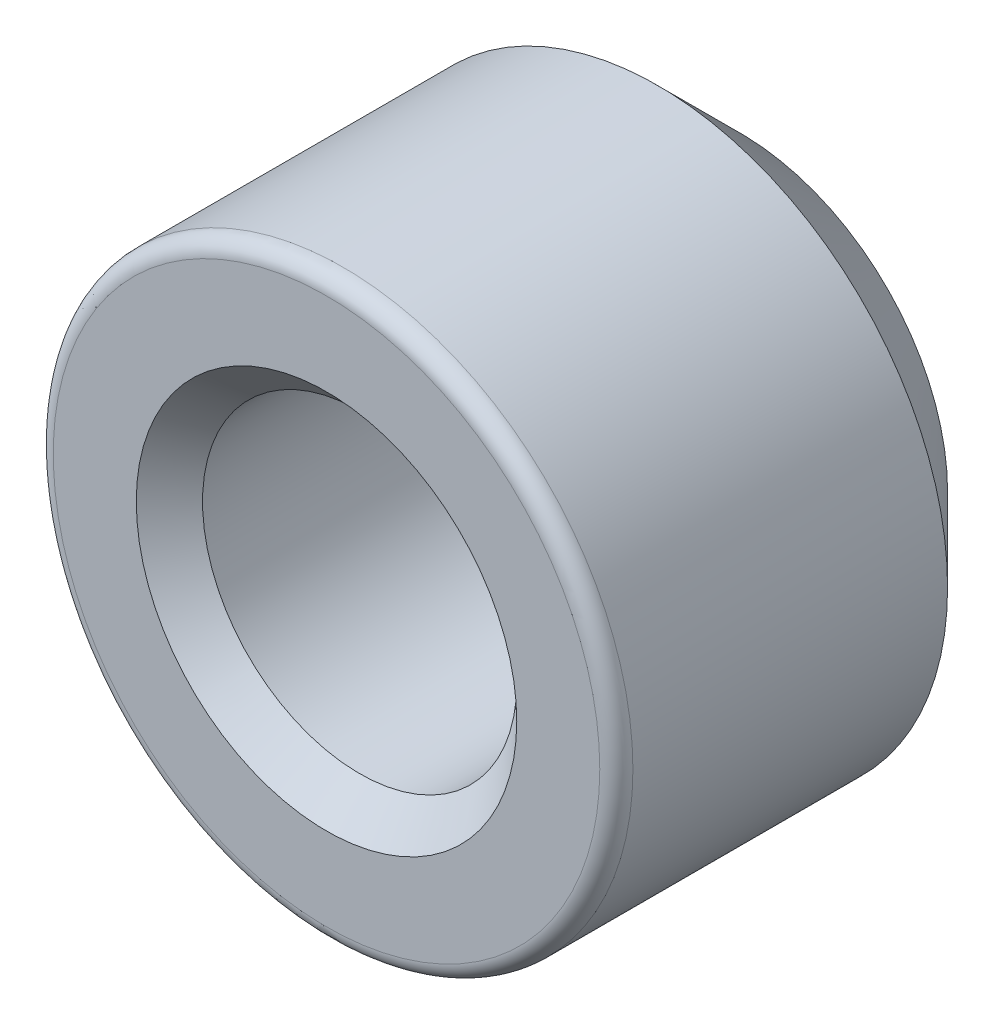
ISO-10303-21;
HEADER;
FILE_DESCRIPTION(('STEP AP214'),'2;1');
FILE_NAME('part.step','',(''),(''),'','','');
FILE_SCHEMA(('AUTOMOTIVE_DESIGN { 1 0 10303 214 1 1 1 1 }'));
ENDSEC;
DATA;
#1=APPLICATION_CONTEXT('core data for automotive mechanical design processes');
#2=APPLICATION_PROTOCOL_DEFINITION('international standard','automotive_design',2000,#1);
#3=PRODUCT_CONTEXT('',#1,'mechanical');
#4=PRODUCT('Part','Part','',(#3));
#5=PRODUCT_RELATED_PRODUCT_CATEGORY('part','',(#4));
#6=PRODUCT_DEFINITION_FORMATION('','',#4);
#7=PRODUCT_DEFINITION_CONTEXT('part definition',#1,'design');
#8=PRODUCT_DEFINITION('design','',#6,#7);
#9=PRODUCT_DEFINITION_SHAPE('','',#8);
#10=(LENGTH_UNIT() NAMED_UNIT(*) SI_UNIT(.MILLI.,.METRE.));
#11=(NAMED_UNIT(*) PLANE_ANGLE_UNIT() SI_UNIT($,.RADIAN.));
#12=(NAMED_UNIT(*) SI_UNIT($,.STERADIAN.) SOLID_ANGLE_UNIT());
#13=UNCERTAINTY_MEASURE_WITH_UNIT(LENGTH_MEASURE(1.E-05),#10,'distance_accuracy_value','');
#14=(GEOMETRIC_REPRESENTATION_CONTEXT(3) GLOBAL_UNCERTAINTY_ASSIGNED_CONTEXT((#13)) GLOBAL_UNIT_ASSIGNED_CONTEXT((#10,
#11,#12)) REPRESENTATION_CONTEXT('',''));
#15=CARTESIAN_POINT('',(0.,0.,0.));
#16=DIRECTION('',(0.,0.,1.));
#17=DIRECTION('',(1.,0.,0.));
#18=AXIS2_PLACEMENT_3D('',#15,#16,#17);
#19=CARTESIAN_POINT('',(0.,0.,12.5));
#20=DIRECTION('',(0.,0.,-1.));
#21=DIRECTION('',(-1.,0.,0.));
#22=AXIS2_PLACEMENT_3D('',#19,#20,#21);
#23=CYLINDRICAL_SURFACE('',#22,17.5);
#24=CARTESIAN_POINT('',(0.,0.,11.5));
#25=DIRECTION('',(0.,0.,1.));
#26=DIRECTION('',(1.,0.,0.));
#27=AXIS2_PLACEMENT_3D('',#24,#25,#26);
#28=CIRCLE('',#27,17.5);
#29=CARTESIAN_POINT('',(17.5,0.,11.5));
#30=VERTEX_POINT('',#29);
#31=EDGE_CURVE('E10',#30,#30,#28,.F.);
#32=ORIENTED_EDGE('',*,*,#31,.T.);
#33=EDGE_LOOP('',(#32));
#34=FACE_BOUND('',#33,.T.);
#35=CARTESIAN_POINT('',(0.,0.,-7.5));
#36=DIRECTION('',(0.,0.,1.));
#37=DIRECTION('',(1.,0.,0.));
#38=AXIS2_PLACEMENT_3D('',#35,#36,#37);
#39=CIRCLE('',#38,17.5);
#40=CARTESIAN_POINT('',(17.5,0.,-7.5));
#41=VERTEX_POINT('',#40);
#42=EDGE_CURVE('E56',#41,#41,#39,.T.);
#43=ORIENTED_EDGE('',*,*,#42,.T.);
#44=EDGE_LOOP('',(#43));
#45=FACE_BOUND('',#44,.T.);
#46=ADVANCED_FACE('F33',(#34,#45),#23,.T.);
#47=CARTESIAN_POINT('',(0.,0.,12.5));
#48=DIRECTION('',(0.,0.,1.));
#49=DIRECTION('',(1.,0.,0.));
#50=AXIS2_PLACEMENT_3D('',#47,#48,#49);
#51=PLANE('',#50);
#52=CARTESIAN_POINT('',(0.,0.,12.5));
#53=DIRECTION('',(0.,0.,1.));
#54=DIRECTION('',(1.,0.,0.));
#55=AXIS2_PLACEMENT_3D('',#52,#53,#54);
#56=CIRCLE('',#55,16.5);
#57=CARTESIAN_POINT('',(16.5,0.,12.5));
#58=VERTEX_POINT('',#57);
#59=EDGE_CURVE('E40',#58,#58,#56,.T.);
#60=ORIENTED_EDGE('',*,*,#59,.T.);
#61=EDGE_LOOP('',(#60));
#62=FACE_BOUND('',#61,.T.);
#63=CARTESIAN_POINT('',(0.,0.,12.5));
#64=DIRECTION('',(0.,0.,1.));
#65=DIRECTION('',(1.,0.,0.));
#66=AXIS2_PLACEMENT_3D('',#63,#64,#65);
#67=CIRCLE('',#66,11.4869);
#68=CARTESIAN_POINT('',(11.4869,0.,12.5));
#69=VERTEX_POINT('',#68);
#70=EDGE_CURVE('E44',#69,#69,#67,.F.);
#71=ORIENTED_EDGE('',*,*,#70,.T.);
#72=EDGE_LOOP('',(#71));
#73=FACE_BOUND('',#72,.T.);
#74=ADVANCED_FACE('F77',(#62,#73),#51,.T.);
#75=CARTESIAN_POINT('',(0.,0.,-12.5));
#76=DIRECTION('',(0.,0.,1.));
#77=DIRECTION('',(1.,0.,0.));
#78=AXIS2_PLACEMENT_3D('',#75,#76,#77);
#79=PLANE('',#78);
#80=CARTESIAN_POINT('',(0.,0.,-12.5));
#81=DIRECTION('',(0.,0.,1.));
#82=DIRECTION('',(1.,0.,0.));
#83=AXIS2_PLACEMENT_3D('',#80,#81,#82);
#84=CIRCLE('',#83,12.5);
#85=CARTESIAN_POINT('',(12.5,0.,-12.5));
#86=VERTEX_POINT('',#85);
#87=EDGE_CURVE('E53',#86,#86,#84,.F.);
#88=ORIENTED_EDGE('',*,*,#87,.T.);
#89=EDGE_LOOP('',(#88));
#90=FACE_BOUND('',#89,.T.);
#91=CARTESIAN_POINT('',(0.,0.,-12.5));
#92=DIRECTION('',(0.,0.,1.));
#93=DIRECTION('',(1.,0.,0.));
#94=AXIS2_PLACEMENT_3D('',#91,#92,#93);
#95=CIRCLE('',#94,9.48689999999999);
#96=CARTESIAN_POINT('',(9.48689999999999,0.,-12.5));
#97=VERTEX_POINT('',#96);
#98=EDGE_CURVE('E59',#97,#97,#95,.T.);
#99=ORIENTED_EDGE('',*,*,#98,.T.);
#100=EDGE_LOOP('',(#99));
#101=FACE_BOUND('',#100,.T.);
#102=ADVANCED_FACE('F63',(#90,#101),#79,.F.);
#103=CARTESIAN_POINT('',(0.,0.,12.5));
#104=DIRECTION('',(0.,0.,1.));
#105=DIRECTION('',(1.,0.,0.));
#106=AXIS2_PLACEMENT_3D('',#103,#104,#105);
#107=CYLINDRICAL_SURFACE('',#106,9.48689999999999);
#108=CARTESIAN_POINT('',(0.,0.,10.5));
#109=DIRECTION('',(0.,0.,1.));
#110=DIRECTION('',(1.,0.,0.));
#111=AXIS2_PLACEMENT_3D('',#108,#109,#110);
#112=CIRCLE('',#111,9.48689999999999);
#113=CARTESIAN_POINT('',(9.48689999999999,0.,10.5));
#114=VERTEX_POINT('',#113);
#115=EDGE_CURVE('E48',#114,#114,#112,.T.);
#116=ORIENTED_EDGE('',*,*,#115,.T.);
#117=EDGE_LOOP('',(#116));
#118=FACE_BOUND('',#117,.T.);
#119=ORIENTED_EDGE('',*,*,#98,.F.);
#120=EDGE_LOOP('',(#119));
#121=FACE_BOUND('',#120,.T.);
#122=ADVANCED_FACE('F65',(#118,#121),#107,.F.);
#123=CARTESIAN_POINT('',(0.,0.,-7.5));
#124=DIRECTION('',(0.,0.,1.));
#125=DIRECTION('',(1.,0.,0.));
#126=AXIS2_PLACEMENT_3D('',#123,#124,#125);
#127=CONICAL_SURFACE('',#126,17.5,0.78539816339745);
#128=ORIENTED_EDGE('',*,*,#87,.F.);
#129=EDGE_LOOP('',(#128));
#130=FACE_BOUND('',#129,.T.);
#131=ORIENTED_EDGE('',*,*,#42,.F.);
#132=EDGE_LOOP('',(#131));
#133=FACE_BOUND('',#132,.T.);
#134=ADVANCED_FACE('F67',(#130,#133),#127,.T.);
#135=CARTESIAN_POINT('',(0.,0.,10.5));
#136=DIRECTION('',(0.,0.,1.));
#137=DIRECTION('',(1.,0.,0.));
#138=AXIS2_PLACEMENT_3D('',#135,#136,#137);
#139=CONICAL_SURFACE('',#138,9.48689999999999,0.785398163397449);
#140=ORIENTED_EDGE('',*,*,#70,.F.);
#141=EDGE_LOOP('',(#140));
#142=FACE_BOUND('',#141,.T.);
#143=ORIENTED_EDGE('',*,*,#115,.F.);
#144=EDGE_LOOP('',(#143));
#145=FACE_BOUND('',#144,.T.);
#146=ADVANCED_FACE('F74',(#142,#145),#139,.F.);
#147=CARTESIAN_POINT('',(0.,0.,11.5));
#148=DIRECTION('',(0.,0.,1.));
#149=DIRECTION('',(1.,0.,0.));
#150=AXIS2_PLACEMENT_3D('',#147,#148,#149);
#151=TOROIDAL_SURFACE('',#150,16.5,1.);
#152=ORIENTED_EDGE('',*,*,#31,.F.);
#153=EDGE_LOOP('',(#152));
#154=FACE_BOUND('',#153,.T.);
#155=ORIENTED_EDGE('',*,*,#59,.F.);
#156=EDGE_LOOP('',(#155));
#157=FACE_BOUND('',#156,.T.);
#158=ADVANCED_FACE('F35',(#154,#157),#151,.T.);
#159=CLOSED_SHELL('',(#46,#74,#102,#122,#134,#146,#158));
#160=MANIFOLD_SOLID_BREP('B2',#159);
#161=ADVANCED_BREP_SHAPE_REPRESENTATION('',(#18,#160),#14);
#162=SHAPE_DEFINITION_REPRESENTATION(#9,#161);
ENDSEC;
END-ISO-10303-21;
